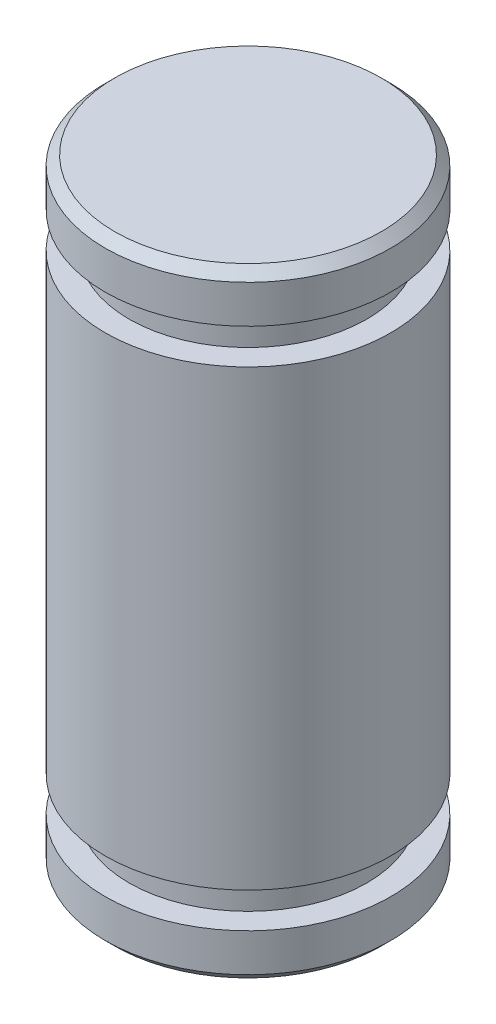
ISO-10303-21;
HEADER;
FILE_DESCRIPTION(('STEP AP214'),'2;1');
FILE_NAME('part.step','',(''),(''),'','','');
FILE_SCHEMA(('AUTOMOTIVE_DESIGN { 1 0 10303 214 1 1 1 1 }'));
ENDSEC;
DATA;
#1=APPLICATION_CONTEXT('core data for automotive mechanical design processes');
#2=APPLICATION_PROTOCOL_DEFINITION('international standard','automotive_design',2000,#1);
#3=PRODUCT_CONTEXT('',#1,'mechanical');
#4=PRODUCT('Part','Part','',(#3));
#5=PRODUCT_RELATED_PRODUCT_CATEGORY('part','',(#4));
#6=PRODUCT_DEFINITION_FORMATION('','',#4);
#7=PRODUCT_DEFINITION_CONTEXT('part definition',#1,'design');
#8=PRODUCT_DEFINITION('design','',#6,#7);
#9=PRODUCT_DEFINITION_SHAPE('','',#8);
#10=(LENGTH_UNIT() NAMED_UNIT(*) SI_UNIT(.MILLI.,.METRE.));
#11=(NAMED_UNIT(*) PLANE_ANGLE_UNIT() SI_UNIT($,.RADIAN.));
#12=(NAMED_UNIT(*) SI_UNIT($,.STERADIAN.) SOLID_ANGLE_UNIT());
#13=UNCERTAINTY_MEASURE_WITH_UNIT(LENGTH_MEASURE(1.E-05),#10,'distance_accuracy_value','');
#14=(GEOMETRIC_REPRESENTATION_CONTEXT(3) GLOBAL_UNCERTAINTY_ASSIGNED_CONTEXT((#13)) GLOBAL_UNIT_ASSIGNED_CONTEXT((#10,
#11,#12)) REPRESENTATION_CONTEXT('',''));
#15=CARTESIAN_POINT('',(0.,0.,0.));
#16=DIRECTION('',(0.,0.,1.));
#17=DIRECTION('',(1.,0.,0.));
#18=AXIS2_PLACEMENT_3D('',#15,#16,#17);
#19=CARTESIAN_POINT('',(0.,0.,0.));
#20=DIRECTION('',(0.,-1.,0.));
#21=DIRECTION('',(0.,0.,-1.));
#22=AXIS2_PLACEMENT_3D('',#19,#20,#21);
#23=CYLINDRICAL_SURFACE('',#22,3.);
#24=CARTESIAN_POINT('',(0.,1.74,0.));
#25=DIRECTION('',(0.,-1.,0.));
#26=DIRECTION('',(0.,0.,-1.));
#27=AXIS2_PLACEMENT_3D('',#24,#25,#26);
#28=CIRCLE('',#27,3.);
#29=CARTESIAN_POINT('',(0.,1.74,-3.));
#30=VERTEX_POINT('',#29);
#31=EDGE_CURVE('E61',#30,#30,#28,.F.);
#32=ORIENTED_EDGE('',*,*,#31,.T.);
#33=EDGE_LOOP('',(#32));
#34=FACE_BOUND('',#33,.T.);
#35=CARTESIAN_POINT('',(0.,11.26,0.));
#36=DIRECTION('',(0.,1.,0.));
#37=DIRECTION('',(0.,0.,1.));
#38=AXIS2_PLACEMENT_3D('',#35,#36,#37);
#39=CIRCLE('',#38,3.);
#40=CARTESIAN_POINT('',(0.,11.26,3.));
#41=VERTEX_POINT('',#40);
#42=EDGE_CURVE('E55',#41,#41,#39,.F.);
#43=ORIENTED_EDGE('',*,*,#42,.T.);
#44=EDGE_LOOP('',(#43));
#45=FACE_BOUND('',#44,.T.);
#46=ADVANCED_FACE('F30',(#34,#45),#23,.T.);
#47=CARTESIAN_POINT('',(0.,0.200000000000002,0.));
#48=DIRECTION('',(0.,-1.,0.));
#49=DIRECTION('',(0.,0.,-1.));
#50=AXIS2_PLACEMENT_3D('',#47,#48,#49);
#51=CIRCLE('',#50,3.);
#52=CARTESIAN_POINT('',(0.,0.200000000000002,-3.));
#53=VERTEX_POINT('',#52);
#54=EDGE_CURVE('E41',#53,#53,#51,.F.);
#55=ORIENTED_EDGE('',*,*,#54,.T.);
#56=EDGE_LOOP('',(#55));
#57=FACE_BOUND('',#56,.T.);
#58=CARTESIAN_POINT('',(0.,1.,0.));
#59=DIRECTION('',(0.,1.,0.));
#60=DIRECTION('',(0.,0.,1.));
#61=AXIS2_PLACEMENT_3D('',#58,#59,#60);
#62=CIRCLE('',#61,3.);
#63=CARTESIAN_POINT('',(0.,1.,3.));
#64=VERTEX_POINT('',#63);
#65=EDGE_CURVE('E50',#64,#64,#62,.F.);
#66=ORIENTED_EDGE('',*,*,#65,.T.);
#67=EDGE_LOOP('',(#66));
#68=FACE_BOUND('',#67,.T.);
#69=ADVANCED_FACE('F93',(#57,#68),#23,.T.);
#70=CARTESIAN_POINT('',(0.,0.,0.));
#71=DIRECTION('',(0.,-1.,0.));
#72=DIRECTION('',(0.,0.,-1.));
#73=AXIS2_PLACEMENT_3D('',#70,#71,#72);
#74=PLANE('',#73);
#75=CARTESIAN_POINT('',(0.,0.,0.));
#76=DIRECTION('',(0.,-1.,0.));
#77=DIRECTION('',(0.,0.,-1.));
#78=AXIS2_PLACEMENT_3D('',#75,#76,#77);
#79=CIRCLE('',#78,2.8);
#80=CARTESIAN_POINT('',(0.,0.,-2.8));
#81=VERTEX_POINT('',#80);
#82=EDGE_CURVE('E45',#81,#81,#79,.T.);
#83=ORIENTED_EDGE('',*,*,#82,.T.);
#84=EDGE_LOOP('',(#83));
#85=FACE_BOUND('',#84,.T.);
#86=ADVANCED_FACE('F100',(#85),#74,.T.);
#87=CARTESIAN_POINT('',(0.,50.0288087537218,0.));
#88=DIRECTION('',(0.,-1.,0.));
#89=DIRECTION('',(0.,0.,-1.));
#90=AXIS2_PLACEMENT_3D('',#87,#88,#89);
#91=CYLINDRICAL_SURFACE('',#90,2.5);
#92=CARTESIAN_POINT('',(0.,1.74,0.));
#93=DIRECTION('',(0.,-1.,0.));
#94=DIRECTION('',(0.,0.,-1.));
#95=AXIS2_PLACEMENT_3D('',#92,#93,#94);
#96=CIRCLE('',#95,2.5);
#97=CARTESIAN_POINT('',(0.,1.74,-2.5));
#98=VERTEX_POINT('',#97);
#99=EDGE_CURVE('E54',#98,#98,#96,.T.);
#100=ORIENTED_EDGE('',*,*,#99,.T.);
#101=EDGE_LOOP('',(#100));
#102=FACE_BOUND('',#101,.T.);
#103=CARTESIAN_POINT('',(0.,1.,0.));
#104=DIRECTION('',(0.,-1.,0.));
#105=DIRECTION('',(0.,0.,-1.));
#106=AXIS2_PLACEMENT_3D('',#103,#104,#105);
#107=CIRCLE('',#106,2.5);
#108=CARTESIAN_POINT('',(0.,1.,-2.5));
#109=VERTEX_POINT('',#108);
#110=EDGE_CURVE('E64',#109,#109,#107,.T.);
#111=ORIENTED_EDGE('',*,*,#110,.F.);
#112=EDGE_LOOP('',(#111));
#113=FACE_BOUND('',#112,.T.);
#114=ADVANCED_FACE('F149',(#102,#113),#91,.T.);
#115=CARTESIAN_POINT('',(0.,1.,-4.55000000000001));
#116=DIRECTION('',(0.,1.,0.));
#117=DIRECTION('',(0.,0.,1.));
#118=AXIS2_PLACEMENT_3D('',#115,#116,#117);
#119=PLANE('',#118);
#120=ORIENTED_EDGE('',*,*,#65,.F.);
#121=EDGE_LOOP('',(#120));
#122=FACE_BOUND('',#121,.T.);
#123=ORIENTED_EDGE('',*,*,#110,.T.);
#124=EDGE_LOOP('',(#123));
#125=FACE_BOUND('',#124,.T.);
#126=ADVANCED_FACE('F89',(#122,#125),#119,.T.);
#127=CARTESIAN_POINT('',(0.,1.74,-4.55000000000001));
#128=DIRECTION('',(0.,-1.,0.));
#129=DIRECTION('',(0.,0.,-1.));
#130=AXIS2_PLACEMENT_3D('',#127,#128,#129);
#131=PLANE('',#130);
#132=ORIENTED_EDGE('',*,*,#31,.F.);
#133=EDGE_LOOP('',(#132));
#134=FACE_BOUND('',#133,.T.);
#135=ORIENTED_EDGE('',*,*,#99,.F.);
#136=EDGE_LOOP('',(#135));
#137=FACE_BOUND('',#136,.T.);
#138=ADVANCED_FACE('F80',(#134,#137),#131,.T.);
#139=CARTESIAN_POINT('',(0.,50.0288087537218,0.));
#140=DIRECTION('',(0.,-1.,0.));
#141=DIRECTION('',(0.,0.,-1.));
#142=AXIS2_PLACEMENT_3D('',#139,#140,#141);
#143=CYLINDRICAL_SURFACE('',#142,2.5);
#144=CARTESIAN_POINT('',(0.,12.,0.));
#145=DIRECTION('',(0.,-1.,0.));
#146=DIRECTION('',(0.,0.,-1.));
#147=AXIS2_PLACEMENT_3D('',#144,#145,#146);
#148=CIRCLE('',#147,2.5);
#149=CARTESIAN_POINT('',(0.,12.,-2.5));
#150=VERTEX_POINT('',#149);
#151=EDGE_CURVE('E58',#150,#150,#148,.T.);
#152=ORIENTED_EDGE('',*,*,#151,.T.);
#153=EDGE_LOOP('',(#152));
#154=FACE_BOUND('',#153,.T.);
#155=CARTESIAN_POINT('',(0.,11.26,0.));
#156=DIRECTION('',(0.,-1.,0.));
#157=DIRECTION('',(0.,0.,-1.));
#158=AXIS2_PLACEMENT_3D('',#155,#156,#157);
#159=CIRCLE('',#158,2.5);
#160=CARTESIAN_POINT('',(0.,11.26,-2.5));
#161=VERTEX_POINT('',#160);
#162=EDGE_CURVE('E71',#161,#161,#159,.T.);
#163=ORIENTED_EDGE('',*,*,#162,.F.);
#164=EDGE_LOOP('',(#163));
#165=FACE_BOUND('',#164,.T.);
#166=ADVANCED_FACE('F77',(#154,#165),#143,.T.);
#167=CARTESIAN_POINT('',(0.,12.,-2.5));
#168=DIRECTION('',(0.,-1.,0.));
#169=DIRECTION('',(0.,0.,-1.));
#170=AXIS2_PLACEMENT_3D('',#167,#168,#169);
#171=PLANE('',#170);
#172=CARTESIAN_POINT('',(0.,12.,0.));
#173=DIRECTION('',(0.,-1.,0.));
#174=DIRECTION('',(0.,0.,-1.));
#175=AXIS2_PLACEMENT_3D('',#172,#173,#174);
#176=CIRCLE('',#175,3.);
#177=CARTESIAN_POINT('',(0.,12.,-3.));
#178=VERTEX_POINT('',#177);
#179=EDGE_CURVE('E51',#178,#178,#176,.F.);
#180=ORIENTED_EDGE('',*,*,#179,.F.);
#181=EDGE_LOOP('',(#180));
#182=FACE_BOUND('',#181,.T.);
#183=ORIENTED_EDGE('',*,*,#151,.F.);
#184=EDGE_LOOP('',(#183));
#185=FACE_BOUND('',#184,.T.);
#186=ADVANCED_FACE('F79',(#182,#185),#171,.T.);
#187=CARTESIAN_POINT('',(0.,11.26,-2.5));
#188=DIRECTION('',(0.,1.,0.));
#189=DIRECTION('',(0.,0.,1.));
#190=AXIS2_PLACEMENT_3D('',#187,#188,#189);
#191=PLANE('',#190);
#192=ORIENTED_EDGE('',*,*,#42,.F.);
#193=EDGE_LOOP('',(#192));
#194=FACE_BOUND('',#193,.T.);
#195=ORIENTED_EDGE('',*,*,#162,.T.);
#196=EDGE_LOOP('',(#195));
#197=FACE_BOUND('',#196,.T.);
#198=ADVANCED_FACE('F75',(#194,#197),#191,.T.);
#199=CARTESIAN_POINT('',(0.,13.,0.));
#200=DIRECTION('',(0.,1.,0.));
#201=DIRECTION('',(0.,0.,1.));
#202=AXIS2_PLACEMENT_3D('',#199,#200,#201);
#203=PLANE('',#202);
#204=CARTESIAN_POINT('',(0.,13.,0.));
#205=DIRECTION('',(0.,1.,0.));
#206=DIRECTION('',(0.,0.,1.));
#207=AXIS2_PLACEMENT_3D('',#204,#205,#206);
#208=CIRCLE('',#207,2.8);
#209=CARTESIAN_POINT('',(0.,13.,2.8));
#210=VERTEX_POINT('',#209);
#211=EDGE_CURVE('E10',#210,#210,#208,.T.);
#212=ORIENTED_EDGE('',*,*,#211,.T.);
#213=EDGE_LOOP('',(#212));
#214=FACE_BOUND('',#213,.T.);
#215=ADVANCED_FACE('F107',(#214),#203,.T.);
#216=CARTESIAN_POINT('',(0.,12.8,0.));
#217=DIRECTION('',(0.,1.,0.));
#218=DIRECTION('',(0.,0.,1.));
#219=AXIS2_PLACEMENT_3D('',#216,#217,#218);
#220=CIRCLE('',#219,3.);
#221=CARTESIAN_POINT('',(0.,12.8,3.));
#222=VERTEX_POINT('',#221);
#223=EDGE_CURVE('E37',#222,#222,#220,.F.);
#224=ORIENTED_EDGE('',*,*,#223,.T.);
#225=EDGE_LOOP('',(#224));
#226=FACE_BOUND('',#225,.T.);
#227=ORIENTED_EDGE('',*,*,#179,.T.);
#228=EDGE_LOOP('',(#227));
#229=FACE_BOUND('',#228,.T.);
#230=ADVANCED_FACE('F96',(#226,#229),#23,.T.);
#231=CARTESIAN_POINT('',(0.,0.,0.));
#232=DIRECTION('',(0.,1.,0.));
#233=DIRECTION('',(0.,0.,1.));
#234=AXIS2_PLACEMENT_3D('',#231,#232,#233);
#235=CONICAL_SURFACE('',#234,2.8,0.785398163397447);
#236=ORIENTED_EDGE('',*,*,#54,.F.);
#237=EDGE_LOOP('',(#236));
#238=FACE_BOUND('',#237,.T.);
#239=ORIENTED_EDGE('',*,*,#82,.F.);
#240=EDGE_LOOP('',(#239));
#241=FACE_BOUND('',#240,.T.);
#242=ADVANCED_FACE('F106',(#238,#241),#235,.T.);
#243=CARTESIAN_POINT('',(0.,12.8,0.));
#244=DIRECTION('',(0.,-1.,0.));
#245=DIRECTION('',(0.,0.,-1.));
#246=AXIS2_PLACEMENT_3D('',#243,#244,#245);
#247=CONICAL_SURFACE('',#246,3.,0.785398163397439);
#248=ORIENTED_EDGE('',*,*,#211,.F.);
#249=EDGE_LOOP('',(#248));
#250=FACE_BOUND('',#249,.T.);
#251=ORIENTED_EDGE('',*,*,#223,.F.);
#252=EDGE_LOOP('',(#251));
#253=FACE_BOUND('',#252,.T.);
#254=ADVANCED_FACE('F32',(#250,#253),#247,.T.);
#255=CLOSED_SHELL('',(#46,#69,#86,#114,#126,#138,#166,#186,#198,#215,#230,#242,#254));
#256=MANIFOLD_SOLID_BREP('B2',#255);
#257=ADVANCED_BREP_SHAPE_REPRESENTATION('',(#18,#256),#14);
#258=SHAPE_DEFINITION_REPRESENTATION(#9,#257);
ENDSEC;
END-ISO-10303-21;
